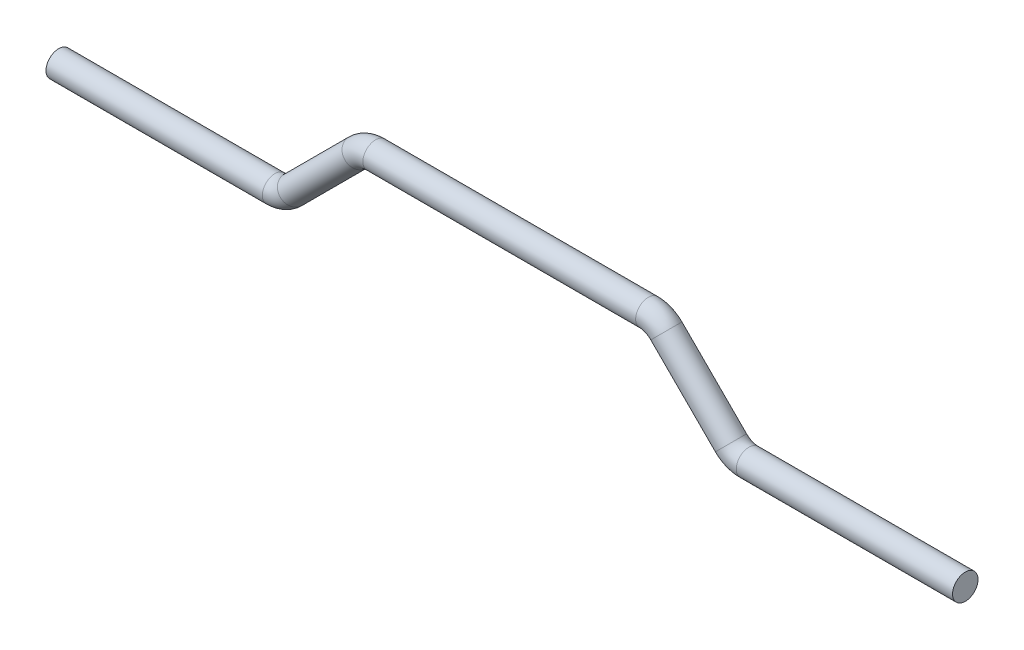
ISO-10303-21;
HEADER;
FILE_DESCRIPTION(('STEP AP214'),'2;1');
FILE_NAME('part.step','',(''),(''),'','','');
FILE_SCHEMA(('AUTOMOTIVE_DESIGN { 1 0 10303 214 1 1 1 1 }'));
ENDSEC;
DATA;
#1=APPLICATION_CONTEXT('core data for automotive mechanical design processes');
#2=APPLICATION_PROTOCOL_DEFINITION('international standard','automotive_design',2000,#1);
#3=PRODUCT_CONTEXT('',#1,'mechanical');
#4=PRODUCT('Part','Part','',(#3));
#5=PRODUCT_RELATED_PRODUCT_CATEGORY('part','',(#4));
#6=PRODUCT_DEFINITION_FORMATION('','',#4);
#7=PRODUCT_DEFINITION_CONTEXT('part definition',#1,'design');
#8=PRODUCT_DEFINITION('design','',#6,#7);
#9=PRODUCT_DEFINITION_SHAPE('','',#8);
#10=(LENGTH_UNIT() NAMED_UNIT(*) SI_UNIT(.MILLI.,.METRE.));
#11=(NAMED_UNIT(*) PLANE_ANGLE_UNIT() SI_UNIT($,.RADIAN.));
#12=(NAMED_UNIT(*) SI_UNIT($,.STERADIAN.) SOLID_ANGLE_UNIT());
#13=UNCERTAINTY_MEASURE_WITH_UNIT(LENGTH_MEASURE(1.E-05),#10,'distance_accuracy_value','');
#14=(GEOMETRIC_REPRESENTATION_CONTEXT(3) GLOBAL_UNCERTAINTY_ASSIGNED_CONTEXT((#13)) GLOBAL_UNIT_ASSIGNED_CONTEXT((#10,
#11,#12)) REPRESENTATION_CONTEXT('',''));
#15=CARTESIAN_POINT('',(0.,0.,0.));
#16=DIRECTION('',(0.,0.,1.));
#17=DIRECTION('',(1.,0.,0.));
#18=AXIS2_PLACEMENT_3D('',#15,#16,#17);
#19=CARTESIAN_POINT('',(74.5000000000001,-25.0000000000001,-1.11022302462516E-13));
#20=DIRECTION('',(1.,0.,0.));
#21=DIRECTION('',(0.,0.999999999999999,0.));
#22=AXIS2_PLACEMENT_3D('',#19,#20,#21);
#23=CYLINDRICAL_SURFACE('',#22,4.);
#24=CARTESIAN_POINT('',(74.5000000000001,-25.0000000000001,-1.11022302462516E-13));
#25=DIRECTION('',(-1.,0.,0.));
#26=DIRECTION('',(0.,-0.999999999999999,0.));
#27=AXIS2_PLACEMENT_3D('',#24,#25,#26);
#28=CIRCLE('',#27,4.);
#29=CARTESIAN_POINT('',(74.5000000000001,-29.0000000000001,-1.11022302462516E-13));
#30=VERTEX_POINT('',#29);
#31=EDGE_CURVE('E43',#30,#30,#28,.T.);
#32=ORIENTED_EDGE('',*,*,#31,.F.);
#33=EDGE_LOOP('',(#32));
#34=FACE_BOUND('',#33,.T.);
#35=CARTESIAN_POINT('',(142.5,-25.0000000000004,2.22044604925031E-13));
#36=DIRECTION('',(-1.,0.,0.));
#37=DIRECTION('',(0.,-0.999999999999999,0.));
#38=AXIS2_PLACEMENT_3D('',#35,#36,#37);
#39=CIRCLE('',#38,4.);
#40=CARTESIAN_POINT('',(142.5,-29.0000000000004,2.21600515715181E-13));
#41=VERTEX_POINT('',#40);
#42=EDGE_CURVE('E10',#41,#41,#39,.T.);
#43=ORIENTED_EDGE('',*,*,#42,.T.);
#44=EDGE_LOOP('',(#43));
#45=FACE_BOUND('',#44,.T.);
#46=ADVANCED_FACE('F37',(#34,#45),#23,.T.);
#47=CARTESIAN_POINT('',(74.5000000000001,-17.0000000000001,-1.11022302462516E-13));
#48=DIRECTION('',(0.,0.,1.));
#49=DIRECTION('',(1.,0.,0.));
#50=AXIS2_PLACEMENT_3D('',#47,#48,#49);
#51=TOROIDAL_SURFACE('',#50,8.00000000000001,4.);
#52=CARTESIAN_POINT('',(68.8431457505075,-22.6568542494925,-2.22044604925031E-13));
#53=DIRECTION('',(-0.707106781186545,0.70710678118655,0.));
#54=DIRECTION('',(-0.707106781186553,-0.707106781186544,0.));
#55=AXIS2_PLACEMENT_3D('',#52,#53,#54);
#56=CIRCLE('',#55,4.);
#57=CARTESIAN_POINT('',(66.0147186257613,-25.4852813742385,-2.77555756156287E-13));
#58=VERTEX_POINT('',#57);
#59=EDGE_CURVE('E47',#58,#58,#56,.T.);
#60=CARTESIAN_POINT('',(74.5000000000001,-17.0000000000001,-1.11022302462516E-13));
#61=DIRECTION('',(0.,0.,1.));
#62=DIRECTION('',(1.,0.,0.));
#63=AXIS2_PLACEMENT_3D('',#60,#61,#62);
#64=CIRCLE('',#63,12.);
#65=EDGE_CURVE('',#58,#30,#64,.T.);
#66=ORIENTED_EDGE('',*,*,#59,.F.);
#67=ORIENTED_EDGE('',*,*,#31,.T.);
#68=ORIENTED_EDGE('',*,*,#65,.T.);
#69=ORIENTED_EDGE('',*,*,#65,.F.);
#70=EDGE_LOOP('',(#66,#68,#67,#69));
#71=FACE_BOUND('',#70,.T.);
#72=ADVANCED_FACE('F111',(#71),#51,.T.);
#73=CARTESIAN_POINT('',(48.5294372515231,-2.34314575050765,0.));
#74=DIRECTION('',(0.707106781186544,-0.70710678118655,0.));
#75=DIRECTION('',(0.707106781186553,0.707106781186544,0.));
#76=AXIS2_PLACEMENT_3D('',#73,#74,#75);
#77=CYLINDRICAL_SURFACE('',#76,4.);
#78=CARTESIAN_POINT('',(48.5294372515231,-2.34314575050765,0.));
#79=DIRECTION('',(-0.707106781186545,0.70710678118655,0.));
#80=DIRECTION('',(-0.707106781186553,-0.707106781186544,0.));
#81=AXIS2_PLACEMENT_3D('',#78,#79,#80);
#82=CIRCLE('',#81,4.);
#83=CARTESIAN_POINT('',(51.3578643762693,0.485281374238537,-1.11022302462516E-13));
#84=VERTEX_POINT('',#83);
#85=EDGE_CURVE('E51',#84,#84,#82,.T.);
#86=ORIENTED_EDGE('',*,*,#85,.F.);
#87=EDGE_LOOP('',(#86));
#88=FACE_BOUND('',#87,.T.);
#89=ORIENTED_EDGE('',*,*,#59,.T.);
#90=EDGE_LOOP('',(#89));
#91=FACE_BOUND('',#90,.T.);
#92=ADVANCED_FACE('F105',(#88,#91),#77,.T.);
#93=CARTESIAN_POINT('',(42.8725830020307,-8.00000000000001,2.22044604925031E-13));
#94=DIRECTION('',(0.,0.,-1.));
#95=DIRECTION('',(-1.,0.,0.));
#96=AXIS2_PLACEMENT_3D('',#93,#94,#95);
#97=TOROIDAL_SURFACE('',#96,7.99999999999998,4.);
#98=CARTESIAN_POINT('',(42.8725830020307,0.,0.));
#99=DIRECTION('',(-1.,0.,0.));
#100=DIRECTION('',(0.,-0.999999999999999,0.));
#101=AXIS2_PLACEMENT_3D('',#98,#99,#100);
#102=CIRCLE('',#101,4.);
#103=CARTESIAN_POINT('',(42.8725830020307,3.99999999999998,-1.11022302462515E-13));
#104=VERTEX_POINT('',#103);
#105=EDGE_CURVE('E56',#104,#104,#102,.T.);
#106=CARTESIAN_POINT('',(42.8725830020307,-8.00000000000001,2.22044604925031E-13));
#107=DIRECTION('',(0.,0.,-1.));
#108=DIRECTION('',(-1.,0.,0.));
#109=AXIS2_PLACEMENT_3D('',#106,#107,#108);
#110=CIRCLE('',#109,12.);
#111=EDGE_CURVE('',#104,#84,#110,.T.);
#112=ORIENTED_EDGE('',*,*,#105,.F.);
#113=ORIENTED_EDGE('',*,*,#85,.T.);
#114=ORIENTED_EDGE('',*,*,#111,.T.);
#115=ORIENTED_EDGE('',*,*,#111,.F.);
#116=EDGE_LOOP('',(#112,#114,#113,#115));
#117=FACE_BOUND('',#116,.T.);
#118=ADVANCED_FACE('F99',(#117),#97,.T.);
#119=CARTESIAN_POINT('',(-42.8725830020307,0.,-1.11022302462516E-13));
#120=DIRECTION('',(1.,0.,0.));
#121=DIRECTION('',(0.,0.999999999999999,0.));
#122=AXIS2_PLACEMENT_3D('',#119,#120,#121);
#123=CYLINDRICAL_SURFACE('',#122,4.);
#124=CARTESIAN_POINT('',(-42.8725830020307,0.,-1.11022302462516E-13));
#125=DIRECTION('',(-1.,0.,0.));
#126=DIRECTION('',(0.,-0.999999999999999,0.));
#127=AXIS2_PLACEMENT_3D('',#124,#125,#126);
#128=CIRCLE('',#127,4.);
#129=CARTESIAN_POINT('',(-42.8725830020307,4.0000000000002,-1.66533453693778E-13));
#130=VERTEX_POINT('',#129);
#131=EDGE_CURVE('E59',#130,#130,#128,.T.);
#132=ORIENTED_EDGE('',*,*,#131,.F.);
#133=EDGE_LOOP('',(#132));
#134=FACE_BOUND('',#133,.T.);
#135=ORIENTED_EDGE('',*,*,#105,.T.);
#136=EDGE_LOOP('',(#135));
#137=FACE_BOUND('',#136,.T.);
#138=ADVANCED_FACE('F93',(#134,#137),#123,.T.);
#139=CARTESIAN_POINT('',(-42.8725830020307,-7.99999999999979,0.));
#140=DIRECTION('',(0.,0.,-1.));
#141=DIRECTION('',(-1.,0.,0.));
#142=AXIS2_PLACEMENT_3D('',#139,#140,#141);
#143=TOROIDAL_SURFACE('',#142,7.99999999999999,4.);
#144=CARTESIAN_POINT('',(-48.5294372515233,-2.34314575050765,0.));
#145=DIRECTION('',(-0.707106781186545,-0.707106781186551,0.));
#146=DIRECTION('',(0.707106781186552,-0.707106781186542,0.));
#147=AXIS2_PLACEMENT_3D('',#144,#145,#146);
#148=CIRCLE('',#147,4.);
#149=CARTESIAN_POINT('',(-51.3578643762696,0.485281374238427,0.));
#150=VERTEX_POINT('',#149);
#151=EDGE_CURVE('E62',#150,#150,#148,.T.);
#152=CARTESIAN_POINT('',(-42.8725830020307,-7.99999999999979,0.));
#153=DIRECTION('',(0.,0.,-1.));
#154=DIRECTION('',(-1.,0.,0.));
#155=AXIS2_PLACEMENT_3D('',#152,#153,#154);
#156=CIRCLE('',#155,12.);
#157=EDGE_CURVE('',#150,#130,#156,.T.);
#158=ORIENTED_EDGE('',*,*,#151,.F.);
#159=ORIENTED_EDGE('',*,*,#131,.T.);
#160=ORIENTED_EDGE('',*,*,#157,.T.);
#161=ORIENTED_EDGE('',*,*,#157,.F.);
#162=EDGE_LOOP('',(#158,#160,#159,#161));
#163=FACE_BOUND('',#162,.T.);
#164=ADVANCED_FACE('F87',(#163),#143,.T.);
#165=CARTESIAN_POINT('',(-68.843145750508,-22.6568542494925,0.));
#166=DIRECTION('',(0.707106781186546,0.707106781186551,0.));
#167=DIRECTION('',(-0.707106781186552,0.707106781186543,0.));
#168=AXIS2_PLACEMENT_3D('',#165,#166,#167);
#169=CYLINDRICAL_SURFACE('',#168,4.);
#170=CARTESIAN_POINT('',(-68.843145750508,-22.6568542494925,0.));
#171=DIRECTION('',(-0.707106781186545,-0.707106781186551,0.));
#172=DIRECTION('',(0.707106781186552,-0.707106781186542,0.));
#173=AXIS2_PLACEMENT_3D('',#170,#171,#172);
#174=CIRCLE('',#173,4.);
#175=CARTESIAN_POINT('',(-66.0147186257619,-25.4852813742386,0.));
#176=VERTEX_POINT('',#175);
#177=EDGE_CURVE('E65',#176,#176,#174,.T.);
#178=ORIENTED_EDGE('',*,*,#177,.F.);
#179=EDGE_LOOP('',(#178));
#180=FACE_BOUND('',#179,.T.);
#181=ORIENTED_EDGE('',*,*,#151,.T.);
#182=EDGE_LOOP('',(#181));
#183=FACE_BOUND('',#182,.T.);
#184=ADVANCED_FACE('F81',(#180,#183),#169,.T.);
#185=CARTESIAN_POINT('',(-74.5000000000003,-16.9999999999999,0.));
#186=DIRECTION('',(0.,0.,1.));
#187=DIRECTION('',(1.,0.,0.));
#188=AXIS2_PLACEMENT_3D('',#185,#186,#187);
#189=TOROIDAL_SURFACE('',#188,8.00000000000001,4.);
#190=CARTESIAN_POINT('',(-74.5000000000001,-25.0000000000004,1.11022302462516E-13));
#191=DIRECTION('',(-1.,0.,0.));
#192=DIRECTION('',(0.,-0.999999999999999,0.));
#193=AXIS2_PLACEMENT_3D('',#190,#191,#192);
#194=CIRCLE('',#193,4.);
#195=CARTESIAN_POINT('',(-74.5,-28.9999999999999,1.66533453693764E-13));
#196=VERTEX_POINT('',#195);
#197=EDGE_CURVE('E68',#196,#196,#194,.T.);
#198=CARTESIAN_POINT('',(-74.5000000000003,-16.9999999999999,0.));
#199=DIRECTION('',(0.,0.,1.));
#200=DIRECTION('',(1.,0.,0.));
#201=AXIS2_PLACEMENT_3D('',#198,#199,#200);
#202=CIRCLE('',#201,12.);
#203=EDGE_CURVE('',#196,#176,#202,.T.);
#204=ORIENTED_EDGE('',*,*,#197,.F.);
#205=ORIENTED_EDGE('',*,*,#177,.T.);
#206=ORIENTED_EDGE('',*,*,#203,.T.);
#207=ORIENTED_EDGE('',*,*,#203,.F.);
#208=EDGE_LOOP('',(#204,#206,#205,#207));
#209=FACE_BOUND('',#208,.T.);
#210=ADVANCED_FACE('F78',(#209),#189,.T.);
#211=CARTESIAN_POINT('',(-74.5000000000001,-25.0000000000004,1.11022302462516E-13));
#212=DIRECTION('',(-1.,0.,0.));
#213=DIRECTION('',(0.,-0.999999999999999,0.));
#214=AXIS2_PLACEMENT_3D('',#211,#212,#213);
#215=CYLINDRICAL_SURFACE('',#214,4.);
#216=ORIENTED_EDGE('',*,*,#197,.T.);
#217=EDGE_LOOP('',(#216));
#218=FACE_BOUND('',#217,.T.);
#219=CARTESIAN_POINT('',(-142.5,-25.0000000000004,1.11022302462516E-13));
#220=DIRECTION('',(-1.,0.,0.));
#221=DIRECTION('',(0.,-0.999999999999999,0.));
#222=AXIS2_PLACEMENT_3D('',#219,#220,#221);
#223=CIRCLE('',#222,4.);
#224=CARTESIAN_POINT('',(-142.5,-29.0000000000004,1.10356168647741E-13));
#225=VERTEX_POINT('',#224);
#226=EDGE_CURVE('E69',#225,#225,#223,.T.);
#227=ORIENTED_EDGE('',*,*,#226,.F.);
#228=EDGE_LOOP('',(#227));
#229=FACE_BOUND('',#228,.T.);
#230=ADVANCED_FACE('F75',(#218,#229),#215,.T.);
#231=CARTESIAN_POINT('',(142.5,-25.0000000000004,2.22044604925031E-13));
#232=DIRECTION('',(-1.,0.,0.));
#233=DIRECTION('',(0.,-0.999999999999999,0.));
#234=AXIS2_PLACEMENT_3D('',#231,#232,#233);
#235=PLANE('',#234);
#236=ORIENTED_EDGE('',*,*,#42,.F.);
#237=EDGE_LOOP('',(#236));
#238=FACE_BOUND('',#237,.T.);
#239=ADVANCED_FACE('F123',(#238),#235,.F.);
#240=CARTESIAN_POINT('',(-142.5,-25.0000000000004,1.11022302462516E-13));
#241=DIRECTION('',(-1.,0.,0.));
#242=DIRECTION('',(0.,-0.999999999999999,0.));
#243=AXIS2_PLACEMENT_3D('',#240,#241,#242);
#244=PLANE('',#243);
#245=ORIENTED_EDGE('',*,*,#226,.T.);
#246=EDGE_LOOP('',(#245));
#247=FACE_BOUND('',#246,.T.);
#248=ADVANCED_FACE('F124',(#247),#244,.T.);
#249=CLOSED_SHELL('',(#46,#72,#92,#118,#138,#164,#184,#210,#230,#239,#248));
#250=MANIFOLD_SOLID_BREP('B2',#249);
#251=ADVANCED_BREP_SHAPE_REPRESENTATION('',(#18,#250),#14);
#252=SHAPE_DEFINITION_REPRESENTATION(#9,#251);
ENDSEC;
END-ISO-10303-21;
